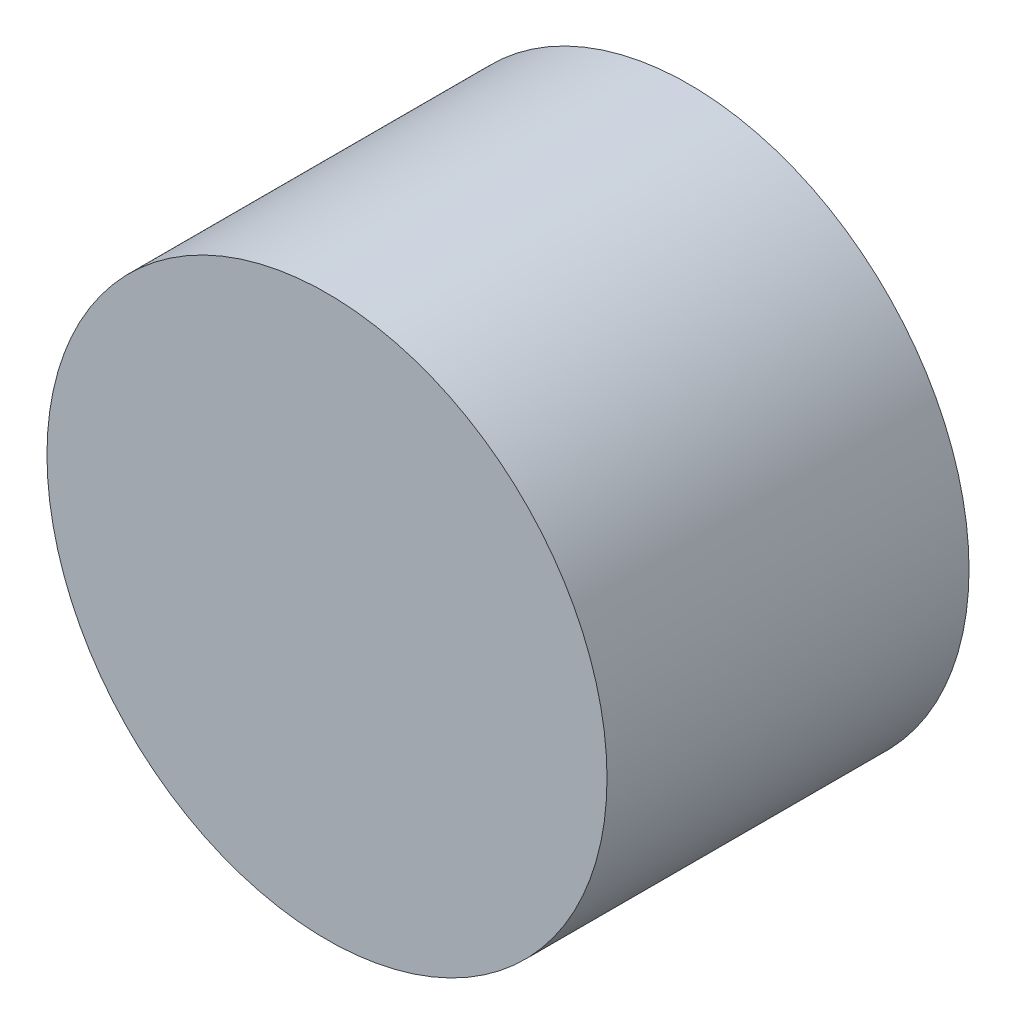
ISO-10303-21;
HEADER;
FILE_DESCRIPTION(('STEP AP214'),'2;1');
FILE_NAME('part.step','',(''),(''),'','','');
FILE_SCHEMA(('AUTOMOTIVE_DESIGN { 1 0 10303 214 1 1 1 1 }'));
ENDSEC;
DATA;
#1=APPLICATION_CONTEXT('core data for automotive mechanical design processes');
#2=APPLICATION_PROTOCOL_DEFINITION('international standard','automotive_design',2000,#1);
#3=PRODUCT_CONTEXT('',#1,'mechanical');
#4=PRODUCT('Part','Part','',(#3));
#5=PRODUCT_RELATED_PRODUCT_CATEGORY('part','',(#4));
#6=PRODUCT_DEFINITION_FORMATION('','',#4);
#7=PRODUCT_DEFINITION_CONTEXT('part definition',#1,'design');
#8=PRODUCT_DEFINITION('design','',#6,#7);
#9=PRODUCT_DEFINITION_SHAPE('','',#8);
#10=(LENGTH_UNIT() NAMED_UNIT(*) SI_UNIT(.MILLI.,.METRE.));
#11=(NAMED_UNIT(*) PLANE_ANGLE_UNIT() SI_UNIT($,.RADIAN.));
#12=(NAMED_UNIT(*) SI_UNIT($,.STERADIAN.) SOLID_ANGLE_UNIT());
#13=UNCERTAINTY_MEASURE_WITH_UNIT(LENGTH_MEASURE(1.E-05),#10,'distance_accuracy_value','');
#14=(GEOMETRIC_REPRESENTATION_CONTEXT(3) GLOBAL_UNCERTAINTY_ASSIGNED_CONTEXT((#13)) GLOBAL_UNIT_ASSIGNED_CONTEXT((#10,
#11,#12)) REPRESENTATION_CONTEXT('',''));
#15=CARTESIAN_POINT('',(0.,0.,0.));
#16=DIRECTION('',(0.,0.,1.));
#17=DIRECTION('',(1.,0.,0.));
#18=AXIS2_PLACEMENT_3D('',#15,#16,#17);
#19=CARTESIAN_POINT('',(0.,0.,11.));
#20=DIRECTION('',(0.,0.,-1.));
#21=DIRECTION('',(-1.,0.,0.));
#22=AXIS2_PLACEMENT_3D('',#19,#20,#21);
#23=CYLINDRICAL_SURFACE('',#22,8.509);
#24=CARTESIAN_POINT('',(0.,0.,11.));
#25=DIRECTION('',(0.,0.,1.));
#26=DIRECTION('',(1.,0.,0.));
#27=AXIS2_PLACEMENT_3D('',#24,#25,#26);
#28=CIRCLE('',#27,8.509);
#29=CARTESIAN_POINT('',(8.509,0.,11.));
#30=VERTEX_POINT('',#29);
#31=EDGE_CURVE('E10',#30,#30,#28,.T.);
#32=ORIENTED_EDGE('',*,*,#31,.F.);
#33=EDGE_LOOP('',(#32));
#34=FACE_BOUND('',#33,.T.);
#35=CARTESIAN_POINT('',(0.,0.,0.));
#36=DIRECTION('',(0.,0.,1.));
#37=DIRECTION('',(1.,0.,0.));
#38=AXIS2_PLACEMENT_3D('',#35,#36,#37);
#39=CIRCLE('',#38,8.509);
#40=CARTESIAN_POINT('',(8.509,0.,0.));
#41=VERTEX_POINT('',#40);
#42=EDGE_CURVE('E34',#41,#41,#39,.T.);
#43=ORIENTED_EDGE('',*,*,#42,.T.);
#44=EDGE_LOOP('',(#43));
#45=FACE_BOUND('',#44,.T.);
#46=ADVANCED_FACE('F31',(#34,#45),#23,.T.);
#47=CARTESIAN_POINT('',(0.,0.,11.));
#48=DIRECTION('',(0.,0.,1.));
#49=DIRECTION('',(1.,0.,0.));
#50=AXIS2_PLACEMENT_3D('',#47,#48,#49);
#51=PLANE('',#50);
#52=ORIENTED_EDGE('',*,*,#31,.T.);
#53=EDGE_LOOP('',(#52));
#54=FACE_BOUND('',#53,.T.);
#55=ADVANCED_FACE('F46',(#54),#51,.T.);
#56=CARTESIAN_POINT('',(0.,0.,0.));
#57=DIRECTION('',(0.,0.,1.));
#58=DIRECTION('',(1.,0.,0.));
#59=AXIS2_PLACEMENT_3D('',#56,#57,#58);
#60=PLANE('',#59);
#61=ORIENTED_EDGE('',*,*,#42,.F.);
#62=EDGE_LOOP('',(#61));
#63=FACE_BOUND('',#62,.T.);
#64=ADVANCED_FACE('F44',(#63),#60,.F.);
#65=CLOSED_SHELL('',(#46,#55,#64));
#66=MANIFOLD_SOLID_BREP('B2',#65);
#67=ADVANCED_BREP_SHAPE_REPRESENTATION('',(#18,#66),#14);
#68=SHAPE_DEFINITION_REPRESENTATION(#9,#67);
ENDSEC;
END-ISO-10303-21;
